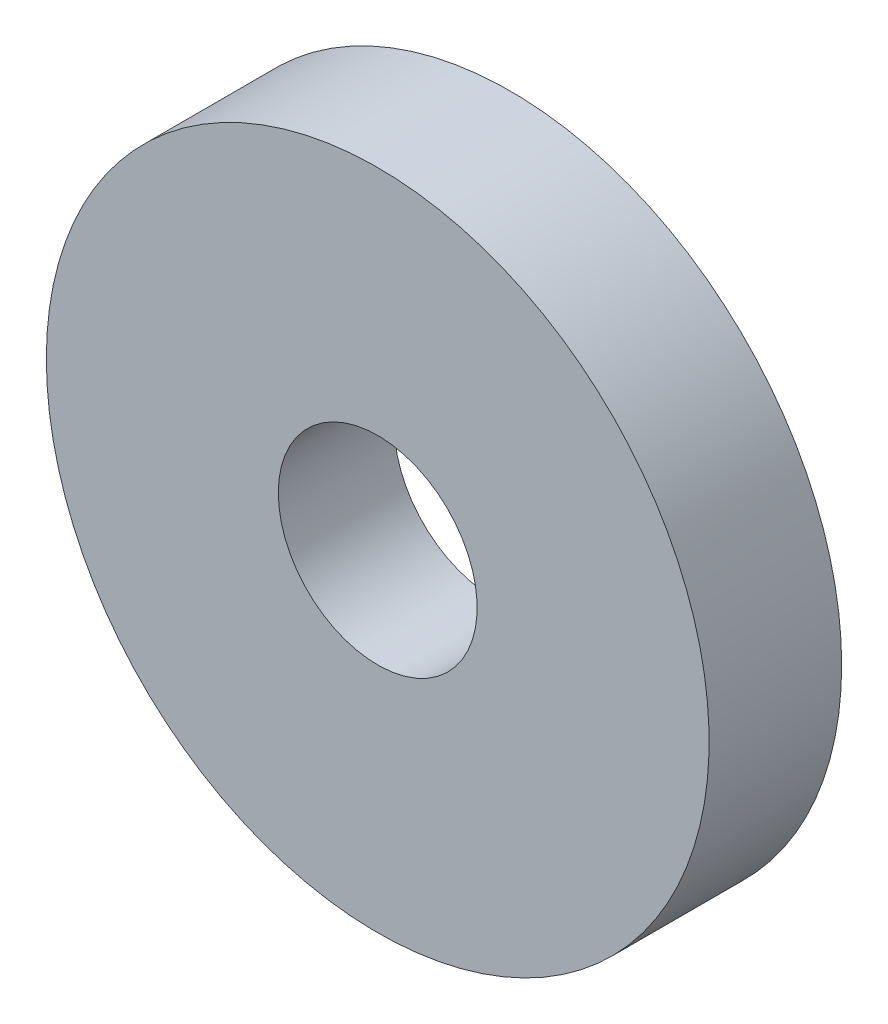
ISO-10303-21;
HEADER;
FILE_DESCRIPTION(('STEP AP214'),'2;1');
FILE_NAME('part.step','',(''),(''),'','','');
FILE_SCHEMA(('AUTOMOTIVE_DESIGN { 1 0 10303 214 1 1 1 1 }'));
ENDSEC;
DATA;
#1=APPLICATION_CONTEXT('core data for automotive mechanical design processes');
#2=APPLICATION_PROTOCOL_DEFINITION('international standard','automotive_design',2000,#1);
#3=PRODUCT_CONTEXT('',#1,'mechanical');
#4=PRODUCT('Part','Part','',(#3));
#5=PRODUCT_RELATED_PRODUCT_CATEGORY('part','',(#4));
#6=PRODUCT_DEFINITION_FORMATION('','',#4);
#7=PRODUCT_DEFINITION_CONTEXT('part definition',#1,'design');
#8=PRODUCT_DEFINITION('design','',#6,#7);
#9=PRODUCT_DEFINITION_SHAPE('','',#8);
#10=(LENGTH_UNIT() NAMED_UNIT(*) SI_UNIT(.MILLI.,.METRE.));
#11=(NAMED_UNIT(*) PLANE_ANGLE_UNIT() SI_UNIT($,.RADIAN.));
#12=(NAMED_UNIT(*) SI_UNIT($,.STERADIAN.) SOLID_ANGLE_UNIT());
#13=UNCERTAINTY_MEASURE_WITH_UNIT(LENGTH_MEASURE(1.E-05),#10,'distance_accuracy_value','');
#14=(GEOMETRIC_REPRESENTATION_CONTEXT(3) GLOBAL_UNCERTAINTY_ASSIGNED_CONTEXT((#13)) GLOBAL_UNIT_ASSIGNED_CONTEXT((#10,
#11,#12)) REPRESENTATION_CONTEXT('',''));
#15=CARTESIAN_POINT('',(0.,0.,0.));
#16=DIRECTION('',(0.,0.,1.));
#17=DIRECTION('',(1.,0.,0.));
#18=AXIS2_PLACEMENT_3D('',#15,#16,#17);
#19=CARTESIAN_POINT('',(0.,0.,57.5685424949239));
#20=DIRECTION('',(0.,0.,-1.));
#21=DIRECTION('',(-1.,0.,0.));
#22=AXIS2_PLACEMENT_3D('',#19,#20,#21);
#23=CYLINDRICAL_SURFACE('',#22,20.);
#24=CARTESIAN_POINT('',(0.,0.,0.));
#25=DIRECTION('',(0.,0.,1.));
#26=DIRECTION('',(1.,0.,0.));
#27=AXIS2_PLACEMENT_3D('',#24,#25,#26);
#28=CIRCLE('',#27,20.);
#29=CARTESIAN_POINT('',(20.,0.,0.));
#30=VERTEX_POINT('',#29);
#31=EDGE_CURVE('E10',#30,#30,#28,.T.);
#32=ORIENTED_EDGE('',*,*,#31,.T.);
#33=EDGE_LOOP('',(#32));
#34=FACE_BOUND('',#33,.T.);
#35=CARTESIAN_POINT('',(0.,0.,8.00000000000001));
#36=DIRECTION('',(0.,0.,-1.));
#37=DIRECTION('',(-1.,0.,0.));
#38=AXIS2_PLACEMENT_3D('',#35,#36,#37);
#39=CIRCLE('',#38,20.);
#40=CARTESIAN_POINT('',(-20.,0.,8.00000000000001));
#41=VERTEX_POINT('',#40);
#42=EDGE_CURVE('E48',#41,#41,#39,.T.);
#43=ORIENTED_EDGE('',*,*,#42,.T.);
#44=EDGE_LOOP('',(#43));
#45=FACE_BOUND('',#44,.T.);
#46=ADVANCED_FACE('F32',(#34,#45),#23,.T.);
#47=CARTESIAN_POINT('',(0.,0.,0.));
#48=DIRECTION('',(0.,0.,1.));
#49=DIRECTION('',(1.,0.,0.));
#50=AXIS2_PLACEMENT_3D('',#47,#48,#49);
#51=PLANE('',#50);
#52=ORIENTED_EDGE('',*,*,#31,.F.);
#53=EDGE_LOOP('',(#52));
#54=FACE_BOUND('',#53,.T.);
#55=CARTESIAN_POINT('',(0.,0.,0.));
#56=DIRECTION('',(0.,0.,1.));
#57=DIRECTION('',(1.,0.,0.));
#58=AXIS2_PLACEMENT_3D('',#55,#56,#57);
#59=CIRCLE('',#58,7.9);
#60=CARTESIAN_POINT('',(7.9,0.,0.));
#61=VERTEX_POINT('',#60);
#62=EDGE_CURVE('E39',#61,#61,#59,.T.);
#63=ORIENTED_EDGE('',*,*,#62,.T.);
#64=EDGE_LOOP('',(#63));
#65=FACE_BOUND('',#64,.T.);
#66=ADVANCED_FACE('F73',(#54,#65),#51,.F.);
#67=CARTESIAN_POINT('',(0.,0.,57.5685424949239));
#68=DIRECTION('',(0.,0.,-1.));
#69=DIRECTION('',(-1.,0.,0.));
#70=AXIS2_PLACEMENT_3D('',#67,#68,#69);
#71=CYLINDRICAL_SURFACE('',#70,7.9);
#72=ORIENTED_EDGE('',*,*,#62,.F.);
#73=EDGE_LOOP('',(#72));
#74=FACE_BOUND('',#73,.T.);
#75=CARTESIAN_POINT('',(0.,0.,1.00000000000001));
#76=DIRECTION('',(0.,0.,1.));
#77=DIRECTION('',(1.,0.,0.));
#78=AXIS2_PLACEMENT_3D('',#75,#76,#77);
#79=CIRCLE('',#78,7.9);
#80=CARTESIAN_POINT('',(7.9,0.,1.00000000000001));
#81=VERTEX_POINT('',#80);
#82=EDGE_CURVE('E35',#81,#81,#79,.T.);
#83=ORIENTED_EDGE('',*,*,#82,.T.);
#84=EDGE_LOOP('',(#83));
#85=FACE_BOUND('',#84,.T.);
#86=ADVANCED_FACE('F69',(#74,#85),#71,.F.);
#87=CARTESIAN_POINT('',(0.,0.,1.00000000000001));
#88=DIRECTION('',(0.,0.,1.));
#89=DIRECTION('',(1.,0.,0.));
#90=AXIS2_PLACEMENT_3D('',#87,#88,#89);
#91=PLANE('',#90);
#92=CARTESIAN_POINT('',(1.80728346042877E-13,1.27875650619112E-13,1.00000000000001));
#93=DIRECTION('',(0.,0.,1.));
#94=DIRECTION('',(1.,0.,0.));
#95=AXIS2_PLACEMENT_3D('',#92,#93,#94);
#96=CIRCLE('',#95,6.);
#97=CARTESIAN_POINT('',(6.00000000000018,1.27875650619112E-13,1.00000000000001));
#98=VERTEX_POINT('',#97);
#99=EDGE_CURVE('E51',#98,#98,#96,.T.);
#100=ORIENTED_EDGE('',*,*,#99,.T.);
#101=EDGE_LOOP('',(#100));
#102=FACE_BOUND('',#101,.T.);
#103=ORIENTED_EDGE('',*,*,#82,.F.);
#104=EDGE_LOOP('',(#103));
#105=FACE_BOUND('',#104,.T.);
#106=ADVANCED_FACE('F55',(#102,#105),#91,.F.);
#107=CARTESIAN_POINT('',(1.80728346042877E-13,1.27875650619112E-13,65.5685424949239));
#108=DIRECTION('',(0.,0.,-1.));
#109=DIRECTION('',(-1.,0.,0.));
#110=AXIS2_PLACEMENT_3D('',#107,#108,#109);
#111=CYLINDRICAL_SURFACE('',#110,6.);
#112=CARTESIAN_POINT('',(1.80728346042877E-13,1.27875650619112E-13,8.00000000000001));
#113=DIRECTION('',(0.,0.,-1.));
#114=DIRECTION('',(-1.,0.,0.));
#115=AXIS2_PLACEMENT_3D('',#112,#113,#114);
#116=CIRCLE('',#115,6.);
#117=CARTESIAN_POINT('',(-5.99999999999982,1.27875650619112E-13,8.00000000000001));
#118=VERTEX_POINT('',#117);
#119=EDGE_CURVE('E45',#118,#118,#116,.T.);
#120=ORIENTED_EDGE('',*,*,#119,.F.);
#121=EDGE_LOOP('',(#120));
#122=FACE_BOUND('',#121,.T.);
#123=ORIENTED_EDGE('',*,*,#99,.F.);
#124=EDGE_LOOP('',(#123));
#125=FACE_BOUND('',#124,.T.);
#126=ADVANCED_FACE('F58',(#122,#125),#111,.F.);
#127=CARTESIAN_POINT('',(1.80728346042877E-13,1.27875650619112E-13,8.00000000000001));
#128=DIRECTION('',(0.,0.,-1.));
#129=DIRECTION('',(-1.,0.,0.));
#130=AXIS2_PLACEMENT_3D('',#127,#128,#129);
#131=PLANE('',#130);
#132=ORIENTED_EDGE('',*,*,#119,.T.);
#133=EDGE_LOOP('',(#132));
#134=FACE_BOUND('',#133,.T.);
#135=ORIENTED_EDGE('',*,*,#42,.F.);
#136=EDGE_LOOP('',(#135));
#137=FACE_BOUND('',#136,.T.);
#138=ADVANCED_FACE('F60',(#134,#137),#131,.F.);
#139=CLOSED_SHELL('',(#46,#66,#86,#106,#126,#138));
#140=MANIFOLD_SOLID_BREP('B2',#139);
#141=ADVANCED_BREP_SHAPE_REPRESENTATION('',(#18,#140),#14);
#142=SHAPE_DEFINITION_REPRESENTATION(#9,#141);
ENDSEC;
END-ISO-10303-21;
